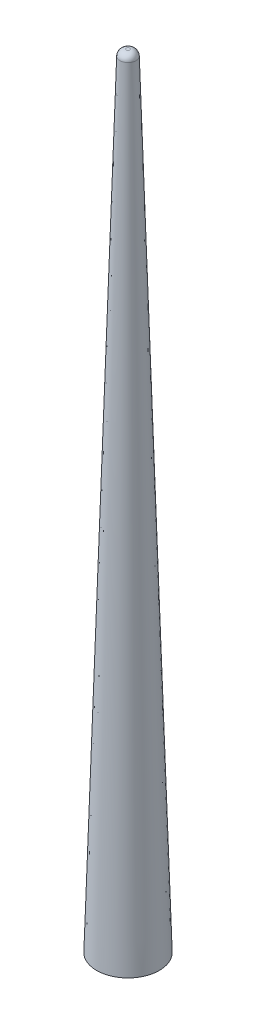
ISO-10303-21;
HEADER;
FILE_DESCRIPTION(('STEP AP214'),'2;1');
FILE_NAME('part.step','',(''),(''),'','','');
FILE_SCHEMA(('AUTOMOTIVE_DESIGN { 1 0 10303 214 1 1 1 1 }'));
ENDSEC;
DATA;
#1=APPLICATION_CONTEXT('core data for automotive mechanical design processes');
#2=APPLICATION_PROTOCOL_DEFINITION('international standard','automotive_design',2000,#1);
#3=PRODUCT_CONTEXT('',#1,'mechanical');
#4=PRODUCT('Part','Part','',(#3));
#5=PRODUCT_RELATED_PRODUCT_CATEGORY('part','',(#4));
#6=PRODUCT_DEFINITION_FORMATION('','',#4);
#7=PRODUCT_DEFINITION_CONTEXT('part definition',#1,'design');
#8=PRODUCT_DEFINITION('design','',#6,#7);
#9=PRODUCT_DEFINITION_SHAPE('','',#8);
#10=(LENGTH_UNIT() NAMED_UNIT(*) SI_UNIT(.MILLI.,.METRE.));
#11=(NAMED_UNIT(*) PLANE_ANGLE_UNIT() SI_UNIT($,.RADIAN.));
#12=(NAMED_UNIT(*) SI_UNIT($,.STERADIAN.) SOLID_ANGLE_UNIT());
#13=UNCERTAINTY_MEASURE_WITH_UNIT(LENGTH_MEASURE(1.E-05),#10,'distance_accuracy_value','');
#14=(GEOMETRIC_REPRESENTATION_CONTEXT(3) GLOBAL_UNCERTAINTY_ASSIGNED_CONTEXT((#13)) GLOBAL_UNIT_ASSIGNED_CONTEXT((#10,
#11,#12)) REPRESENTATION_CONTEXT('',''));
#15=CARTESIAN_POINT('',(0.,0.,0.));
#16=DIRECTION('',(0.,0.,1.));
#17=DIRECTION('',(1.,0.,0.));
#18=AXIS2_PLACEMENT_3D('',#15,#16,#17);
#19=CARTESIAN_POINT('',(0.,250.,0.));
#20=DIRECTION('',(0.,1.,0.));
#21=DIRECTION('',(0.,0.,1.));
#22=AXIS2_PLACEMENT_3D('',#19,#20,#21);
#23=PLANE('',#22);
#24=CARTESIAN_POINT('',(0.,250.,0.));
#25=DIRECTION('',(0.,1.,0.));
#26=DIRECTION('',(0.,0.,1.));
#27=AXIS2_PLACEMENT_3D('',#24,#25,#26);
#28=CIRCLE('',#27,0.559100202408926);
#29=CARTESIAN_POINT('',(0.,250.,0.559100202408926));
#30=VERTEX_POINT('',#29);
#31=EDGE_CURVE('E42',#30,#30,#28,.T.);
#32=ORIENTED_EDGE('',*,*,#31,.T.);
#33=EDGE_LOOP('',(#32));
#34=FACE_BOUND('',#33,.T.);
#35=ADVANCED_FACE('F35',(#34),#23,.T.);
#36=CARTESIAN_POINT('',(0.,0.,0.));
#37=DIRECTION('',(0.,1.,0.));
#38=DIRECTION('',(0.,0.,1.));
#39=AXIS2_PLACEMENT_3D('',#36,#37,#38);
#40=PLANE('',#39);
#41=CARTESIAN_POINT('',(0.,0.,0.));
#42=DIRECTION('',(0.,1.,0.));
#43=DIRECTION('',(0.,0.,1.));
#44=AXIS2_PLACEMENT_3D('',#41,#42,#43);
#45=CIRCLE('',#44,10.);
#46=CARTESIAN_POINT('',(0.,0.,10.));
#47=VERTEX_POINT('',#46);
#48=EDGE_CURVE('E46',#47,#47,#45,.T.);
#49=ORIENTED_EDGE('',*,*,#48,.F.);
#50=EDGE_LOOP('',(#49));
#51=FACE_BOUND('',#50,.T.);
#52=ADVANCED_FACE('F60',(#51),#40,.F.);
#53=CARTESIAN_POINT('',(0.,250.,0.));
#54=DIRECTION('',(0.,-1.,0.));
#55=DIRECTION('',(0.,0.,-1.));
#56=AXIS2_PLACEMENT_3D('',#53,#54,#55);
#57=CONICAL_SURFACE('',#56,2.5,0.0299910048568779);
#58=CARTESIAN_POINT('',(0.,248.059973018211,0.));
#59=DIRECTION('',(0.,1.,0.));
#60=DIRECTION('',(0.,0.,1.));
#61=AXIS2_PLACEMENT_3D('',#58,#59,#60);
#62=CIRCLE('',#61,2.55820080945366);
#63=CARTESIAN_POINT('',(0.,248.059973018211,2.55820080945366));
#64=VERTEX_POINT('',#63);
#65=EDGE_CURVE('E11',#64,#64,#62,.F.);
#66=ORIENTED_EDGE('',*,*,#65,.T.);
#67=EDGE_LOOP('',(#66));
#68=FACE_BOUND('',#67,.T.);
#69=ORIENTED_EDGE('',*,*,#48,.T.);
#70=EDGE_LOOP('',(#69));
#71=FACE_BOUND('',#70,.T.);
#72=ADVANCED_FACE('F69',(#68,#71),#57,.T.);
#73=CARTESIAN_POINT('',(0.,248.,0.));
#74=DIRECTION('',(0.,1.,0.));
#75=DIRECTION('',(0.,0.,1.));
#76=AXIS2_PLACEMENT_3D('',#73,#74,#75);
#77=DEGENERATE_TOROIDAL_SURFACE('',#76,0.559100202408926,2.,.T.);
#78=ORIENTED_EDGE('',*,*,#65,.F.);
#79=EDGE_LOOP('',(#78));
#80=FACE_BOUND('',#79,.T.);
#81=ORIENTED_EDGE('',*,*,#31,.F.);
#82=EDGE_LOOP('',(#81));
#83=FACE_BOUND('',#82,.T.);
#84=ADVANCED_FACE('F37',(#80,#83),#77,.T.);
#85=CLOSED_SHELL('',(#35,#52,#72,#84));
#86=MANIFOLD_SOLID_BREP('B2',#85);
#87=ADVANCED_BREP_SHAPE_REPRESENTATION('',(#18,#86),#14);
#88=SHAPE_DEFINITION_REPRESENTATION(#9,#87);
ENDSEC;
END-ISO-10303-21;
